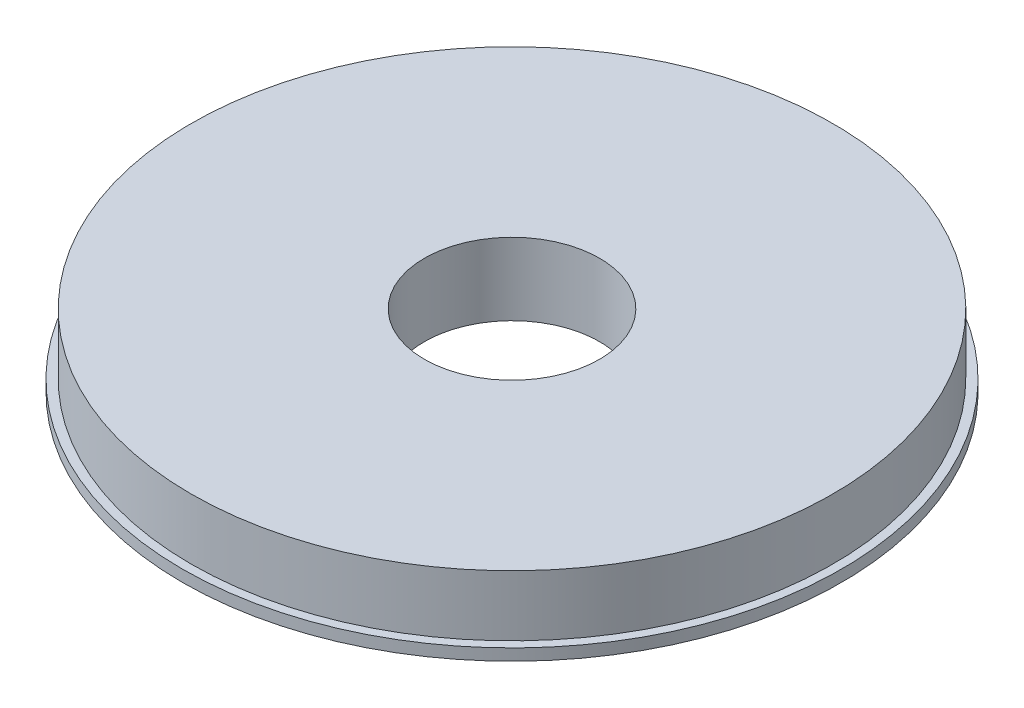
ISO-10303-21;
HEADER;
FILE_DESCRIPTION(('STEP AP214'),'2;1');
FILE_NAME('part.step','',(''),(''),'','','');
FILE_SCHEMA(('AUTOMOTIVE_DESIGN { 1 0 10303 214 1 1 1 1 }'));
ENDSEC;
DATA;
#1=APPLICATION_CONTEXT('core data for automotive mechanical design processes');
#2=APPLICATION_PROTOCOL_DEFINITION('international standard','automotive_design',2000,#1);
#3=PRODUCT_CONTEXT('',#1,'mechanical');
#4=PRODUCT('Part','Part','',(#3));
#5=PRODUCT_RELATED_PRODUCT_CATEGORY('part','',(#4));
#6=PRODUCT_DEFINITION_FORMATION('','',#4);
#7=PRODUCT_DEFINITION_CONTEXT('part definition',#1,'design');
#8=PRODUCT_DEFINITION('design','',#6,#7);
#9=PRODUCT_DEFINITION_SHAPE('','',#8);
#10=(LENGTH_UNIT() NAMED_UNIT(*) SI_UNIT(.MILLI.,.METRE.));
#11=(NAMED_UNIT(*) PLANE_ANGLE_UNIT() SI_UNIT($,.RADIAN.));
#12=(NAMED_UNIT(*) SI_UNIT($,.STERADIAN.) SOLID_ANGLE_UNIT());
#13=UNCERTAINTY_MEASURE_WITH_UNIT(LENGTH_MEASURE(1.E-05),#10,'distance_accuracy_value','');
#14=(GEOMETRIC_REPRESENTATION_CONTEXT(3) GLOBAL_UNCERTAINTY_ASSIGNED_CONTEXT((#13)) GLOBAL_UNIT_ASSIGNED_CONTEXT((#10,
#11,#12)) REPRESENTATION_CONTEXT('',''));
#15=CARTESIAN_POINT('',(0.,0.,0.));
#16=DIRECTION('',(0.,0.,1.));
#17=DIRECTION('',(1.,0.,0.));
#18=AXIS2_PLACEMENT_3D('',#15,#16,#17);
#19=CARTESIAN_POINT('',(0.,12.5,0.));
#20=DIRECTION('',(0.,1.,0.));
#21=DIRECTION('',(0.,0.,1.));
#22=AXIS2_PLACEMENT_3D('',#19,#20,#21);
#23=PLANE('',#22);
#24=CARTESIAN_POINT('',(0.,12.5,0.));
#25=DIRECTION('',(0.,1.,0.));
#26=DIRECTION('',(0.,0.,1.));
#27=AXIS2_PLACEMENT_3D('',#24,#25,#26);
#28=CIRCLE('',#27,55.5);
#29=CARTESIAN_POINT('',(0.,12.5,55.5));
#30=VERTEX_POINT('',#29);
#31=EDGE_CURVE('E10',#30,#30,#28,.T.);
#32=ORIENTED_EDGE('',*,*,#31,.T.);
#33=EDGE_LOOP('',(#32));
#34=FACE_BOUND('',#33,.T.);
#35=CARTESIAN_POINT('',(0.,12.5,0.));
#36=DIRECTION('',(0.,1.,0.));
#37=DIRECTION('',(0.,0.,1.));
#38=AXIS2_PLACEMENT_3D('',#35,#36,#37);
#39=CIRCLE('',#38,15.15);
#40=CARTESIAN_POINT('',(0.,12.5,15.15));
#41=VERTEX_POINT('',#40);
#42=EDGE_CURVE('E38',#41,#41,#39,.T.);
#43=ORIENTED_EDGE('',*,*,#42,.F.);
#44=EDGE_LOOP('',(#43));
#45=FACE_BOUND('',#44,.T.);
#46=ADVANCED_FACE('F31',(#34,#45),#23,.T.);
#47=CARTESIAN_POINT('',(0.,0.,0.));
#48=DIRECTION('',(0.,1.,0.));
#49=DIRECTION('',(0.,0.,1.));
#50=AXIS2_PLACEMENT_3D('',#47,#48,#49);
#51=PLANE('',#50);
#52=CARTESIAN_POINT('',(0.,0.,0.));
#53=DIRECTION('',(0.,1.,0.));
#54=DIRECTION('',(0.,0.,1.));
#55=AXIS2_PLACEMENT_3D('',#52,#53,#54);
#56=CIRCLE('',#55,15.15);
#57=CARTESIAN_POINT('',(0.,0.,15.15));
#58=VERTEX_POINT('',#57);
#59=EDGE_CURVE('E42',#58,#58,#56,.T.);
#60=ORIENTED_EDGE('',*,*,#59,.T.);
#61=EDGE_LOOP('',(#60));
#62=FACE_BOUND('',#61,.T.);
#63=CARTESIAN_POINT('',(0.,0.,0.));
#64=DIRECTION('',(0.,1.,0.));
#65=DIRECTION('',(0.,0.,1.));
#66=AXIS2_PLACEMENT_3D('',#63,#64,#65);
#67=CIRCLE('',#66,57.);
#68=CARTESIAN_POINT('',(0.,0.,57.));
#69=VERTEX_POINT('',#68);
#70=EDGE_CURVE('E49',#69,#69,#67,.T.);
#71=ORIENTED_EDGE('',*,*,#70,.F.);
#72=EDGE_LOOP('',(#71));
#73=FACE_BOUND('',#72,.T.);
#74=ADVANCED_FACE('F74',(#62,#73),#51,.F.);
#75=CARTESIAN_POINT('',(0.,12.5,0.));
#76=DIRECTION('',(0.,-1.,0.));
#77=DIRECTION('',(0.,0.,-1.));
#78=AXIS2_PLACEMENT_3D('',#75,#76,#77);
#79=CYLINDRICAL_SURFACE('',#78,55.5);
#80=CARTESIAN_POINT('',(0.,2.,0.));
#81=DIRECTION('',(0.,1.,0.));
#82=DIRECTION('',(0.,0.,1.));
#83=AXIS2_PLACEMENT_3D('',#80,#81,#82);
#84=CIRCLE('',#83,55.5);
#85=CARTESIAN_POINT('',(0.,2.,55.5));
#86=VERTEX_POINT('',#85);
#87=EDGE_CURVE('E52',#86,#86,#84,.T.);
#88=ORIENTED_EDGE('',*,*,#87,.T.);
#89=EDGE_LOOP('',(#88));
#90=FACE_BOUND('',#89,.T.);
#91=ORIENTED_EDGE('',*,*,#31,.F.);
#92=EDGE_LOOP('',(#91));
#93=FACE_BOUND('',#92,.T.);
#94=ADVANCED_FACE('F33',(#90,#93),#79,.T.);
#95=CARTESIAN_POINT('',(0.,12.5,0.));
#96=DIRECTION('',(0.,-1.,0.));
#97=DIRECTION('',(0.,0.,-1.));
#98=AXIS2_PLACEMENT_3D('',#95,#96,#97);
#99=CYLINDRICAL_SURFACE('',#98,15.15);
#100=ORIENTED_EDGE('',*,*,#42,.T.);
#101=EDGE_LOOP('',(#100));
#102=FACE_BOUND('',#101,.T.);
#103=ORIENTED_EDGE('',*,*,#59,.F.);
#104=EDGE_LOOP('',(#103));
#105=FACE_BOUND('',#104,.T.);
#106=ADVANCED_FACE('F63',(#102,#105),#99,.F.);
#107=CARTESIAN_POINT('',(0.,2.,0.));
#108=DIRECTION('',(0.,1.,0.));
#109=DIRECTION('',(0.,0.,1.));
#110=AXIS2_PLACEMENT_3D('',#107,#108,#109);
#111=PLANE('',#110);
#112=CARTESIAN_POINT('',(0.,2.,0.));
#113=DIRECTION('',(0.,1.,0.));
#114=DIRECTION('',(0.,0.,1.));
#115=AXIS2_PLACEMENT_3D('',#112,#113,#114);
#116=CIRCLE('',#115,57.);
#117=CARTESIAN_POINT('',(0.,2.,57.));
#118=VERTEX_POINT('',#117);
#119=EDGE_CURVE('E47',#118,#118,#116,.T.);
#120=ORIENTED_EDGE('',*,*,#119,.T.);
#121=EDGE_LOOP('',(#120));
#122=FACE_BOUND('',#121,.T.);
#123=ORIENTED_EDGE('',*,*,#87,.F.);
#124=EDGE_LOOP('',(#123));
#125=FACE_BOUND('',#124,.T.);
#126=ADVANCED_FACE('F60',(#122,#125),#111,.T.);
#127=CARTESIAN_POINT('',(0.,2.,0.));
#128=DIRECTION('',(0.,-1.,0.));
#129=DIRECTION('',(0.,0.,-1.));
#130=AXIS2_PLACEMENT_3D('',#127,#128,#129);
#131=CYLINDRICAL_SURFACE('',#130,57.);
#132=ORIENTED_EDGE('',*,*,#119,.F.);
#133=EDGE_LOOP('',(#132));
#134=FACE_BOUND('',#133,.T.);
#135=ORIENTED_EDGE('',*,*,#70,.T.);
#136=EDGE_LOOP('',(#135));
#137=FACE_BOUND('',#136,.T.);
#138=ADVANCED_FACE('F62',(#134,#137),#131,.T.);
#139=CLOSED_SHELL('',(#46,#74,#94,#106,#126,#138));
#140=MANIFOLD_SOLID_BREP('B2',#139);
#141=ADVANCED_BREP_SHAPE_REPRESENTATION('',(#18,#140),#14);
#142=SHAPE_DEFINITION_REPRESENTATION(#9,#141);
ENDSEC;
END-ISO-10303-21;
